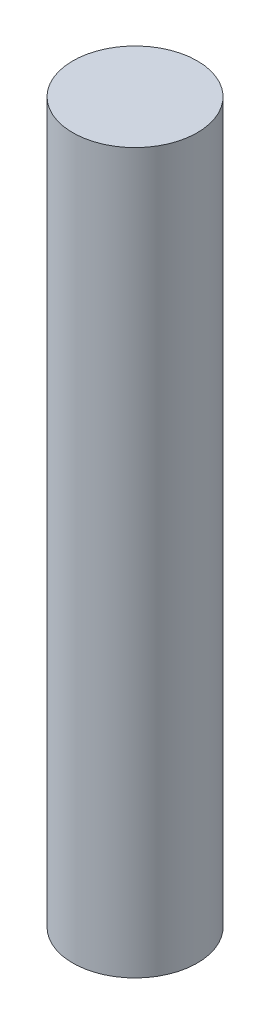
ISO-10303-21;
HEADER;
FILE_DESCRIPTION(('STEP AP214'),'2;1');
FILE_NAME('part.step','',(''),(''),'','','');
FILE_SCHEMA(('AUTOMOTIVE_DESIGN { 1 0 10303 214 1 1 1 1 }'));
ENDSEC;
DATA;
#1=APPLICATION_CONTEXT('core data for automotive mechanical design processes');
#2=APPLICATION_PROTOCOL_DEFINITION('international standard','automotive_design',2000,#1);
#3=PRODUCT_CONTEXT('',#1,'mechanical');
#4=PRODUCT('Part','Part','',(#3));
#5=PRODUCT_RELATED_PRODUCT_CATEGORY('part','',(#4));
#6=PRODUCT_DEFINITION_FORMATION('','',#4);
#7=PRODUCT_DEFINITION_CONTEXT('part definition',#1,'design');
#8=PRODUCT_DEFINITION('design','',#6,#7);
#9=PRODUCT_DEFINITION_SHAPE('','',#8);
#10=(LENGTH_UNIT() NAMED_UNIT(*) SI_UNIT(.MILLI.,.METRE.));
#11=(NAMED_UNIT(*) PLANE_ANGLE_UNIT() SI_UNIT($,.RADIAN.));
#12=(NAMED_UNIT(*) SI_UNIT($,.STERADIAN.) SOLID_ANGLE_UNIT());
#13=UNCERTAINTY_MEASURE_WITH_UNIT(LENGTH_MEASURE(1.E-05),#10,'distance_accuracy_value','');
#14=(GEOMETRIC_REPRESENTATION_CONTEXT(3) GLOBAL_UNCERTAINTY_ASSIGNED_CONTEXT((#13)) GLOBAL_UNIT_ASSIGNED_CONTEXT((#10,
#11,#12)) REPRESENTATION_CONTEXT('',''));
#15=CARTESIAN_POINT('',(0.,0.,0.));
#16=DIRECTION('',(0.,0.,1.));
#17=DIRECTION('',(1.,0.,0.));
#18=AXIS2_PLACEMENT_3D('',#15,#16,#17);
#19=CARTESIAN_POINT('',(0.,11.55,0.));
#20=DIRECTION('',(0.,-1.,0.));
#21=DIRECTION('',(0.,0.,1.));
#22=AXIS2_PLACEMENT_3D('',#19,#20,#21);
#23=CYLINDRICAL_SURFACE('',#22,2.);
#24=CARTESIAN_POINT('',(0.,11.55,0.));
#25=DIRECTION('',(0.,-1.,0.));
#26=DIRECTION('',(0.,0.,-1.));
#27=AXIS2_PLACEMENT_3D('',#24,#25,#26);
#28=CIRCLE('',#27,2.);
#29=CARTESIAN_POINT('',(0.,11.55,-2.));
#30=VERTEX_POINT('',#29);
#31=EDGE_CURVE('E10',#30,#30,#28,.T.);
#32=ORIENTED_EDGE('',*,*,#31,.T.);
#33=EDGE_LOOP('',(#32));
#34=FACE_BOUND('',#33,.T.);
#35=CARTESIAN_POINT('',(0.,-11.55,0.));
#36=DIRECTION('',(0.,-1.,0.));
#37=DIRECTION('',(0.,0.,-1.));
#38=AXIS2_PLACEMENT_3D('',#35,#36,#37);
#39=CIRCLE('',#38,2.);
#40=CARTESIAN_POINT('',(0.,-11.55,-2.));
#41=VERTEX_POINT('',#40);
#42=EDGE_CURVE('E40',#41,#41,#39,.T.);
#43=ORIENTED_EDGE('',*,*,#42,.F.);
#44=EDGE_LOOP('',(#43));
#45=FACE_BOUND('',#44,.T.);
#46=ADVANCED_FACE('F37',(#34,#45),#23,.T.);
#47=CARTESIAN_POINT('',(0.,11.55,0.));
#48=DIRECTION('',(0.,1.,0.));
#49=DIRECTION('',(0.,0.,-1.));
#50=AXIS2_PLACEMENT_3D('',#47,#48,#49);
#51=PLANE('',#50);
#52=ORIENTED_EDGE('',*,*,#31,.F.);
#53=EDGE_LOOP('',(#52));
#54=FACE_BOUND('',#53,.T.);
#55=ADVANCED_FACE('F52',(#54),#51,.T.);
#56=CARTESIAN_POINT('',(0.,-11.55,0.));
#57=DIRECTION('',(0.,1.,0.));
#58=DIRECTION('',(0.,0.,-1.));
#59=AXIS2_PLACEMENT_3D('',#56,#57,#58);
#60=PLANE('',#59);
#61=ORIENTED_EDGE('',*,*,#42,.T.);
#62=EDGE_LOOP('',(#61));
#63=FACE_BOUND('',#62,.T.);
#64=ADVANCED_FACE('F49',(#63),#60,.F.);
#65=CLOSED_SHELL('',(#46,#55,#64));
#66=MANIFOLD_SOLID_BREP('B2',#65);
#67=ADVANCED_BREP_SHAPE_REPRESENTATION('',(#18,#66),#14);
#68=SHAPE_DEFINITION_REPRESENTATION(#9,#67);
ENDSEC;
END-ISO-10303-21;
